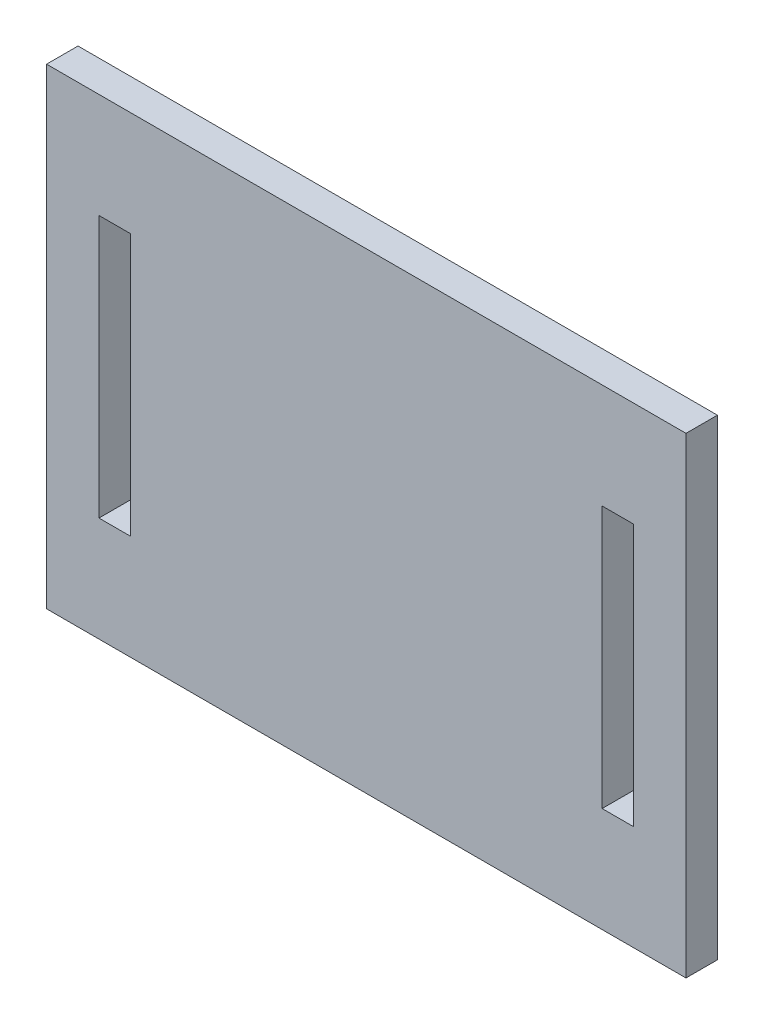
ISO-10303-21;
HEADER;
FILE_DESCRIPTION(('STEP AP214'),'2;1');
FILE_NAME('part.step','',(''),(''),'','','');
FILE_SCHEMA(('AUTOMOTIVE_DESIGN { 1 0 10303 214 1 1 1 1 }'));
ENDSEC;
DATA;
#1=APPLICATION_CONTEXT('core data for automotive mechanical design processes');
#2=APPLICATION_PROTOCOL_DEFINITION('international standard','automotive_design',2000,#1);
#3=PRODUCT_CONTEXT('',#1,'mechanical');
#4=PRODUCT('Part','Part','',(#3));
#5=PRODUCT_RELATED_PRODUCT_CATEGORY('part','',(#4));
#6=PRODUCT_DEFINITION_FORMATION('','',#4);
#7=PRODUCT_DEFINITION_CONTEXT('part definition',#1,'design');
#8=PRODUCT_DEFINITION('design','',#6,#7);
#9=PRODUCT_DEFINITION_SHAPE('','',#8);
#10=(LENGTH_UNIT() NAMED_UNIT(*) SI_UNIT(.MILLI.,.METRE.));
#11=(NAMED_UNIT(*) PLANE_ANGLE_UNIT() SI_UNIT($,.RADIAN.));
#12=(NAMED_UNIT(*) SI_UNIT($,.STERADIAN.) SOLID_ANGLE_UNIT());
#13=UNCERTAINTY_MEASURE_WITH_UNIT(LENGTH_MEASURE(1.E-05),#10,'distance_accuracy_value','');
#14=(GEOMETRIC_REPRESENTATION_CONTEXT(3) GLOBAL_UNCERTAINTY_ASSIGNED_CONTEXT((#13)) GLOBAL_UNIT_ASSIGNED_CONTEXT((#10,
#11,#12)) REPRESENTATION_CONTEXT('',''));
#15=CARTESIAN_POINT('',(0.,0.,0.));
#16=DIRECTION('',(0.,0.,1.));
#17=DIRECTION('',(1.,0.,0.));
#18=AXIS2_PLACEMENT_3D('',#15,#16,#17);
#19=CARTESIAN_POINT('',(-33.3215460110285,14.7916666666667,3.));
#20=DIRECTION('',(1.,0.,0.));
#21=DIRECTION('',(0.,0.,-1.));
#22=AXIS2_PLACEMENT_3D('',#19,#20,#21);
#23=PLANE('',#22);
#24=DIRECTION('',(0.,-1.,0.));
#25=VECTOR('',#24,1.);
#26=CARTESIAN_POINT('',(-33.3215460110285,14.7916666666667,0.));
#27=LINE('',#26,#25);
#28=CARTESIAN_POINT('',(-33.3215460110285,14.7916666666667,0.));
#29=VERTEX_POINT('',#28);
#30=CARTESIAN_POINT('',(-33.3215460110285,-30.2083333333333,0.));
#31=VERTEX_POINT('',#30);
#32=EDGE_CURVE('E185',#29,#31,#27,.T.);
#33=ORIENTED_EDGE('',*,*,#32,.T.);
#34=DIRECTION('',(0.,0.,-1.));
#35=VECTOR('',#34,1.);
#36=CARTESIAN_POINT('',(-33.3215460110285,-30.2083333333333,3.));
#37=LINE('',#36,#35);
#38=CARTESIAN_POINT('',(-33.3215460110285,-30.2083333333333,3.));
#39=VERTEX_POINT('',#38);
#40=EDGE_CURVE('E11',#39,#31,#37,.T.);
#41=ORIENTED_EDGE('',*,*,#40,.F.);
#42=DIRECTION('',(0.,-1.,0.));
#43=VECTOR('',#42,1.);
#44=CARTESIAN_POINT('',(-33.3215460110285,14.7916666666667,3.));
#45=LINE('',#44,#43);
#46=CARTESIAN_POINT('',(-33.3215460110285,14.7916666666667,3.));
#47=VERTEX_POINT('',#46);
#48=EDGE_CURVE('E192',#47,#39,#45,.T.);
#49=ORIENTED_EDGE('',*,*,#48,.F.);
#50=DIRECTION('',(0.,0.,-1.));
#51=VECTOR('',#50,1.);
#52=CARTESIAN_POINT('',(-33.3215460110285,14.7916666666667,3.));
#53=LINE('',#52,#51);
#54=EDGE_CURVE('E202',#47,#29,#53,.T.);
#55=ORIENTED_EDGE('',*,*,#54,.T.);
#56=EDGE_LOOP('',(#33,#41,#49,#55));
#57=FACE_BOUND('',#56,.T.);
#58=ADVANCED_FACE('F35',(#57),#23,.F.);
#59=CARTESIAN_POINT('',(-33.3215460110285,-30.2083333333333,3.));
#60=DIRECTION('',(0.,1.,0.));
#61=DIRECTION('',(0.,0.,1.));
#62=AXIS2_PLACEMENT_3D('',#59,#60,#61);
#63=PLANE('',#62);
#64=DIRECTION('',(1.,0.,0.));
#65=VECTOR('',#64,1.);
#66=CARTESIAN_POINT('',(-33.3215460110285,-30.2083333333333,0.));
#67=LINE('',#66,#65);
#68=CARTESIAN_POINT('',(27.6784539889715,-30.2083333333333,0.));
#69=VERTEX_POINT('',#68);
#70=EDGE_CURVE('E205',#31,#69,#67,.T.);
#71=ORIENTED_EDGE('',*,*,#70,.T.);
#72=DIRECTION('',(0.,0.,-1.));
#73=VECTOR('',#72,1.);
#74=CARTESIAN_POINT('',(27.6784539889715,-30.2083333333333,3.));
#75=LINE('',#74,#73);
#76=CARTESIAN_POINT('',(27.6784539889715,-30.2083333333333,3.));
#77=VERTEX_POINT('',#76);
#78=EDGE_CURVE('E42',#77,#69,#75,.T.);
#79=ORIENTED_EDGE('',*,*,#78,.F.);
#80=DIRECTION('',(1.,0.,0.));
#81=VECTOR('',#80,1.);
#82=CARTESIAN_POINT('',(-33.3215460110285,-30.2083333333333,3.));
#83=LINE('',#82,#81);
#84=EDGE_CURVE('E195',#39,#77,#83,.T.);
#85=ORIENTED_EDGE('',*,*,#84,.F.);
#86=ORIENTED_EDGE('',*,*,#40,.T.);
#87=EDGE_LOOP('',(#71,#79,#85,#86));
#88=FACE_BOUND('',#87,.T.);
#89=ADVANCED_FACE('F234',(#88),#63,.F.);
#90=CARTESIAN_POINT('',(27.6784539889715,14.7916666666667,3.));
#91=DIRECTION('',(-1.,0.,0.));
#92=DIRECTION('',(0.,-1.,0.));
#93=AXIS2_PLACEMENT_3D('',#90,#91,#92);
#94=PLANE('',#93);
#95=DIRECTION('',(0.,1.,0.));
#96=VECTOR('',#95,1.);
#97=CARTESIAN_POINT('',(27.6784539889715,14.7916666666667,0.));
#98=LINE('',#97,#96);
#99=CARTESIAN_POINT('',(27.6784539889715,14.7916666666667,0.));
#100=VERTEX_POINT('',#99);
#101=EDGE_CURVE('E207',#69,#100,#98,.T.);
#102=ORIENTED_EDGE('',*,*,#101,.T.);
#103=DIRECTION('',(0.,0.,-1.));
#104=VECTOR('',#103,1.);
#105=CARTESIAN_POINT('',(27.6784539889715,14.7916666666667,3.));
#106=LINE('',#105,#104);
#107=CARTESIAN_POINT('',(27.6784539889715,14.7916666666667,3.));
#108=VERTEX_POINT('',#107);
#109=EDGE_CURVE('E212',#108,#100,#106,.T.);
#110=ORIENTED_EDGE('',*,*,#109,.F.);
#111=DIRECTION('',(0.,1.,0.));
#112=VECTOR('',#111,1.);
#113=CARTESIAN_POINT('',(27.6784539889715,14.7916666666667,3.));
#114=LINE('',#113,#112);
#115=EDGE_CURVE('E198',#77,#108,#114,.T.);
#116=ORIENTED_EDGE('',*,*,#115,.F.);
#117=ORIENTED_EDGE('',*,*,#78,.T.);
#118=EDGE_LOOP('',(#102,#110,#116,#117));
#119=FACE_BOUND('',#118,.T.);
#120=ADVANCED_FACE('F219',(#119),#94,.F.);
#121=CARTESIAN_POINT('',(-33.3215460110285,14.7916666666667,3.));
#122=DIRECTION('',(0.,-1.,0.));
#123=DIRECTION('',(0.,0.,-1.));
#124=AXIS2_PLACEMENT_3D('',#121,#122,#123);
#125=PLANE('',#124);
#126=DIRECTION('',(-1.,0.,0.));
#127=VECTOR('',#126,1.);
#128=CARTESIAN_POINT('',(-33.3215460110285,14.7916666666667,0.));
#129=LINE('',#128,#127);
#130=EDGE_CURVE('E196',#100,#29,#129,.T.);
#131=ORIENTED_EDGE('',*,*,#130,.T.);
#132=ORIENTED_EDGE('',*,*,#54,.F.);
#133=DIRECTION('',(-1.,0.,0.));
#134=VECTOR('',#133,1.);
#135=CARTESIAN_POINT('',(-33.3215460110285,14.7916666666667,3.));
#136=LINE('',#135,#134);
#137=EDGE_CURVE('E200',#108,#47,#136,.T.);
#138=ORIENTED_EDGE('',*,*,#137,.F.);
#139=ORIENTED_EDGE('',*,*,#109,.T.);
#140=EDGE_LOOP('',(#131,#132,#138,#139));
#141=FACE_BOUND('',#140,.T.);
#142=ADVANCED_FACE('F227',(#141),#125,.F.);
#143=CARTESIAN_POINT('',(0.,0.,3.));
#144=DIRECTION('',(0.,0.,1.));
#145=DIRECTION('',(1.,0.,0.));
#146=AXIS2_PLACEMENT_3D('',#143,#144,#145);
#147=PLANE('',#146);
#148=DIRECTION('',(0.,-1.,0.));
#149=VECTOR('',#148,1.);
#150=CARTESIAN_POINT('',(19.6784539889715,-20.2083333333333,3.));
#151=LINE('',#150,#149);
#152=CARTESIAN_POINT('',(19.6784539889715,4.79166666666667,3.));
#153=VERTEX_POINT('',#152);
#154=CARTESIAN_POINT('',(19.6784539889715,-20.2083333333333,3.));
#155=VERTEX_POINT('',#154);
#156=EDGE_CURVE('E49',#153,#155,#151,.T.);
#157=ORIENTED_EDGE('',*,*,#156,.F.);
#158=DIRECTION('',(-1.,0.,0.));
#159=VECTOR('',#158,1.);
#160=CARTESIAN_POINT('',(19.6784539889715,4.79166666666667,3.));
#161=LINE('',#160,#159);
#162=CARTESIAN_POINT('',(22.6784539889715,4.79166666666667,3.));
#163=VERTEX_POINT('',#162);
#164=EDGE_CURVE('E141',#163,#153,#161,.T.);
#165=ORIENTED_EDGE('',*,*,#164,.F.);
#166=DIRECTION('',(0.,1.,0.));
#167=VECTOR('',#166,1.);
#168=CARTESIAN_POINT('',(22.6784539889715,-20.2083333333333,3.));
#169=LINE('',#168,#167);
#170=CARTESIAN_POINT('',(22.6784539889715,-20.2083333333333,3.));
#171=VERTEX_POINT('',#170);
#172=EDGE_CURVE('E144',#171,#163,#169,.T.);
#173=ORIENTED_EDGE('',*,*,#172,.F.);
#174=DIRECTION('',(1.,0.,0.));
#175=VECTOR('',#174,1.);
#176=CARTESIAN_POINT('',(19.6784539889715,-20.2083333333333,3.));
#177=LINE('',#176,#175);
#178=EDGE_CURVE('E150',#155,#171,#177,.T.);
#179=ORIENTED_EDGE('',*,*,#178,.F.);
#180=EDGE_LOOP('',(#157,#165,#173,#179));
#181=FACE_BOUND('',#180,.T.);
#182=DIRECTION('',(0.,-1.,0.));
#183=VECTOR('',#182,1.);
#184=CARTESIAN_POINT('',(-28.3215460110285,-20.2083333333333,3.));
#185=LINE('',#184,#183);
#186=CARTESIAN_POINT('',(-28.3215460110285,4.79166666666667,3.));
#187=VERTEX_POINT('',#186);
#188=CARTESIAN_POINT('',(-28.3215460110285,-20.2083333333333,3.));
#189=VERTEX_POINT('',#188);
#190=EDGE_CURVE('E156',#187,#189,#185,.T.);
#191=ORIENTED_EDGE('',*,*,#190,.F.);
#192=DIRECTION('',(-1.,0.,0.));
#193=VECTOR('',#192,1.);
#194=CARTESIAN_POINT('',(-28.3215460110285,4.79166666666667,3.));
#195=LINE('',#194,#193);
#196=CARTESIAN_POINT('',(-25.3215460110285,4.79166666666667,3.));
#197=VERTEX_POINT('',#196);
#198=EDGE_CURVE('E164',#197,#187,#195,.T.);
#199=ORIENTED_EDGE('',*,*,#198,.F.);
#200=DIRECTION('',(0.,1.,0.));
#201=VECTOR('',#200,1.);
#202=CARTESIAN_POINT('',(-25.3215460110285,-20.2083333333333,3.));
#203=LINE('',#202,#201);
#204=CARTESIAN_POINT('',(-25.3215460110285,-20.2083333333333,3.));
#205=VERTEX_POINT('',#204);
#206=EDGE_CURVE('E178',#205,#197,#203,.T.);
#207=ORIENTED_EDGE('',*,*,#206,.F.);
#208=DIRECTION('',(1.,0.,0.));
#209=VECTOR('',#208,1.);
#210=CARTESIAN_POINT('',(-28.3215460110285,-20.2083333333333,3.));
#211=LINE('',#210,#209);
#212=EDGE_CURVE('E175',#189,#205,#211,.T.);
#213=ORIENTED_EDGE('',*,*,#212,.F.);
#214=EDGE_LOOP('',(#191,#199,#207,#213));
#215=FACE_BOUND('',#214,.T.);
#216=ORIENTED_EDGE('',*,*,#48,.T.);
#217=ORIENTED_EDGE('',*,*,#84,.T.);
#218=ORIENTED_EDGE('',*,*,#115,.T.);
#219=ORIENTED_EDGE('',*,*,#137,.T.);
#220=EDGE_LOOP('',(#216,#217,#218,#219));
#221=FACE_BOUND('',#220,.T.);
#222=ADVANCED_FACE('F233',(#181,#215,#221),#147,.T.);
#223=CARTESIAN_POINT('',(0.,0.,0.));
#224=DIRECTION('',(0.,0.,1.));
#225=DIRECTION('',(1.,0.,0.));
#226=AXIS2_PLACEMENT_3D('',#223,#224,#225);
#227=PLANE('',#226);
#228=DIRECTION('',(-1.,0.,0.));
#229=VECTOR('',#228,1.);
#230=CARTESIAN_POINT('',(19.6784539889715,4.79166666666667,0.));
#231=LINE('',#230,#229);
#232=CARTESIAN_POINT('',(22.6784539889715,4.79166666666667,0.));
#233=VERTEX_POINT('',#232);
#234=CARTESIAN_POINT('',(19.6784539889715,4.79166666666667,0.));
#235=VERTEX_POINT('',#234);
#236=EDGE_CURVE('E131',#233,#235,#231,.T.);
#237=ORIENTED_EDGE('',*,*,#236,.T.);
#238=DIRECTION('',(0.,-1.,0.));
#239=VECTOR('',#238,1.);
#240=CARTESIAN_POINT('',(19.6784539889715,-20.2083333333333,0.));
#241=LINE('',#240,#239);
#242=CARTESIAN_POINT('',(19.6784539889715,-20.2083333333333,0.));
#243=VERTEX_POINT('',#242);
#244=EDGE_CURVE('E125',#235,#243,#241,.T.);
#245=ORIENTED_EDGE('',*,*,#244,.T.);
#246=DIRECTION('',(1.,0.,0.));
#247=VECTOR('',#246,1.);
#248=CARTESIAN_POINT('',(19.6784539889715,-20.2083333333333,0.));
#249=LINE('',#248,#247);
#250=CARTESIAN_POINT('',(22.6784539889715,-20.2083333333333,0.));
#251=VERTEX_POINT('',#250);
#252=EDGE_CURVE('E134',#243,#251,#249,.T.);
#253=ORIENTED_EDGE('',*,*,#252,.T.);
#254=DIRECTION('',(0.,1.,0.));
#255=VECTOR('',#254,1.);
#256=CARTESIAN_POINT('',(22.6784539889715,-20.2083333333333,0.));
#257=LINE('',#256,#255);
#258=EDGE_CURVE('E57',#251,#233,#257,.T.);
#259=ORIENTED_EDGE('',*,*,#258,.T.);
#260=EDGE_LOOP('',(#237,#245,#253,#259));
#261=FACE_BOUND('',#260,.T.);
#262=DIRECTION('',(-1.,0.,0.));
#263=VECTOR('',#262,1.);
#264=CARTESIAN_POINT('',(-28.3215460110285,4.79166666666667,0.));
#265=LINE('',#264,#263);
#266=CARTESIAN_POINT('',(-25.3215460110285,4.79166666666667,0.));
#267=VERTEX_POINT('',#266);
#268=CARTESIAN_POINT('',(-28.3215460110285,4.79166666666667,0.));
#269=VERTEX_POINT('',#268);
#270=EDGE_CURVE('E170',#267,#269,#265,.T.);
#271=ORIENTED_EDGE('',*,*,#270,.T.);
#272=DIRECTION('',(0.,-1.,0.));
#273=VECTOR('',#272,1.);
#274=CARTESIAN_POINT('',(-28.3215460110285,-20.2083333333333,0.));
#275=LINE('',#274,#273);
#276=CARTESIAN_POINT('',(-28.3215460110285,-20.2083333333333,0.));
#277=VERTEX_POINT('',#276);
#278=EDGE_CURVE('E160',#269,#277,#275,.T.);
#279=ORIENTED_EDGE('',*,*,#278,.T.);
#280=DIRECTION('',(1.,0.,0.));
#281=VECTOR('',#280,1.);
#282=CARTESIAN_POINT('',(-28.3215460110285,-20.2083333333333,0.));
#283=LINE('',#282,#281);
#284=CARTESIAN_POINT('',(-25.3215460110285,-20.2083333333333,0.));
#285=VERTEX_POINT('',#284);
#286=EDGE_CURVE('E163',#277,#285,#283,.T.);
#287=ORIENTED_EDGE('',*,*,#286,.T.);
#288=DIRECTION('',(0.,1.,0.));
#289=VECTOR('',#288,1.);
#290=CARTESIAN_POINT('',(-25.3215460110285,-20.2083333333333,0.));
#291=LINE('',#290,#289);
#292=EDGE_CURVE('E167',#285,#267,#291,.T.);
#293=ORIENTED_EDGE('',*,*,#292,.T.);
#294=EDGE_LOOP('',(#271,#279,#287,#293));
#295=FACE_BOUND('',#294,.T.);
#296=ORIENTED_EDGE('',*,*,#32,.F.);
#297=ORIENTED_EDGE('',*,*,#130,.F.);
#298=ORIENTED_EDGE('',*,*,#101,.F.);
#299=ORIENTED_EDGE('',*,*,#70,.F.);
#300=EDGE_LOOP('',(#296,#297,#298,#299));
#301=FACE_BOUND('',#300,.T.);
#302=ADVANCED_FACE('F138',(#261,#295,#301),#227,.F.);
#303=CARTESIAN_POINT('',(-28.3215460110285,-20.2083333333333,0.));
#304=DIRECTION('',(-1.,0.,0.));
#305=DIRECTION('',(0.,0.,1.));
#306=AXIS2_PLACEMENT_3D('',#303,#304,#305);
#307=PLANE('',#306);
#308=ORIENTED_EDGE('',*,*,#190,.T.);
#309=DIRECTION('',(0.,0.,1.));
#310=VECTOR('',#309,1.);
#311=CARTESIAN_POINT('',(-28.3215460110285,-20.2083333333333,0.));
#312=LINE('',#311,#310);
#313=EDGE_CURVE('E173',#277,#189,#312,.T.);
#314=ORIENTED_EDGE('',*,*,#313,.F.);
#315=ORIENTED_EDGE('',*,*,#278,.F.);
#316=DIRECTION('',(0.,0.,1.));
#317=VECTOR('',#316,1.);
#318=CARTESIAN_POINT('',(-28.3215460110285,4.79166666666667,0.));
#319=LINE('',#318,#317);
#320=EDGE_CURVE('E183',#269,#187,#319,.T.);
#321=ORIENTED_EDGE('',*,*,#320,.T.);
#322=EDGE_LOOP('',(#308,#314,#315,#321));
#323=FACE_BOUND('',#322,.T.);
#324=ADVANCED_FACE('F246',(#323),#307,.F.);
#325=CARTESIAN_POINT('',(-28.3215460110285,4.79166666666667,0.));
#326=DIRECTION('',(0.,1.,0.));
#327=DIRECTION('',(0.,0.,1.));
#328=AXIS2_PLACEMENT_3D('',#325,#326,#327);
#329=PLANE('',#328);
#330=ORIENTED_EDGE('',*,*,#198,.T.);
#331=ORIENTED_EDGE('',*,*,#320,.F.);
#332=ORIENTED_EDGE('',*,*,#270,.F.);
#333=DIRECTION('',(0.,0.,1.));
#334=VECTOR('',#333,1.);
#335=CARTESIAN_POINT('',(-25.3215460110285,4.79166666666667,0.));
#336=LINE('',#335,#334);
#337=EDGE_CURVE('E186',#267,#197,#336,.T.);
#338=ORIENTED_EDGE('',*,*,#337,.T.);
#339=EDGE_LOOP('',(#330,#331,#332,#338));
#340=FACE_BOUND('',#339,.T.);
#341=ADVANCED_FACE('F252',(#340),#329,.F.);
#342=CARTESIAN_POINT('',(-25.3215460110285,-20.2083333333333,0.));
#343=DIRECTION('',(1.,0.,0.));
#344=DIRECTION('',(0.,1.,0.));
#345=AXIS2_PLACEMENT_3D('',#342,#343,#344);
#346=PLANE('',#345);
#347=ORIENTED_EDGE('',*,*,#206,.T.);
#348=ORIENTED_EDGE('',*,*,#337,.F.);
#349=ORIENTED_EDGE('',*,*,#292,.F.);
#350=DIRECTION('',(0.,0.,1.));
#351=VECTOR('',#350,1.);
#352=CARTESIAN_POINT('',(-25.3215460110285,-20.2083333333333,0.));
#353=LINE('',#352,#351);
#354=EDGE_CURVE('E188',#285,#205,#353,.T.);
#355=ORIENTED_EDGE('',*,*,#354,.T.);
#356=EDGE_LOOP('',(#347,#348,#349,#355));
#357=FACE_BOUND('',#356,.T.);
#358=ADVANCED_FACE('F257',(#357),#346,.F.);
#359=CARTESIAN_POINT('',(-28.3215460110285,-20.2083333333333,0.));
#360=DIRECTION('',(0.,-1.,0.));
#361=DIRECTION('',(0.,0.,-1.));
#362=AXIS2_PLACEMENT_3D('',#359,#360,#361);
#363=PLANE('',#362);
#364=ORIENTED_EDGE('',*,*,#212,.T.);
#365=ORIENTED_EDGE('',*,*,#354,.F.);
#366=ORIENTED_EDGE('',*,*,#286,.F.);
#367=ORIENTED_EDGE('',*,*,#313,.T.);
#368=EDGE_LOOP('',(#364,#365,#366,#367));
#369=FACE_BOUND('',#368,.T.);
#370=ADVANCED_FACE('F254',(#369),#363,.F.);
#371=CARTESIAN_POINT('',(19.6784539889715,-20.2083333333333,0.));
#372=DIRECTION('',(-1.,0.,0.));
#373=DIRECTION('',(0.,0.,1.));
#374=AXIS2_PLACEMENT_3D('',#371,#372,#373);
#375=PLANE('',#374);
#376=ORIENTED_EDGE('',*,*,#156,.T.);
#377=DIRECTION('',(0.,0.,1.));
#378=VECTOR('',#377,1.);
#379=CARTESIAN_POINT('',(19.6784539889715,-20.2083333333333,0.));
#380=LINE('',#379,#378);
#381=EDGE_CURVE('E121',#243,#155,#380,.T.);
#382=ORIENTED_EDGE('',*,*,#381,.F.);
#383=ORIENTED_EDGE('',*,*,#244,.F.);
#384=DIRECTION('',(0.,0.,1.));
#385=VECTOR('',#384,1.);
#386=CARTESIAN_POINT('',(19.6784539889715,4.79166666666667,0.));
#387=LINE('',#386,#385);
#388=EDGE_CURVE('E154',#235,#153,#387,.T.);
#389=ORIENTED_EDGE('',*,*,#388,.T.);
#390=EDGE_LOOP('',(#376,#382,#383,#389));
#391=FACE_BOUND('',#390,.T.);
#392=ADVANCED_FACE('F123',(#391),#375,.F.);
#393=CARTESIAN_POINT('',(19.6784539889715,4.79166666666667,0.));
#394=DIRECTION('',(0.,1.,0.));
#395=DIRECTION('',(-1.,0.,0.));
#396=AXIS2_PLACEMENT_3D('',#393,#394,#395);
#397=PLANE('',#396);
#398=ORIENTED_EDGE('',*,*,#164,.T.);
#399=ORIENTED_EDGE('',*,*,#388,.F.);
#400=ORIENTED_EDGE('',*,*,#236,.F.);
#401=DIRECTION('',(0.,0.,1.));
#402=VECTOR('',#401,1.);
#403=CARTESIAN_POINT('',(22.6784539889715,4.79166666666667,0.));
#404=LINE('',#403,#402);
#405=EDGE_CURVE('E157',#233,#163,#404,.T.);
#406=ORIENTED_EDGE('',*,*,#405,.T.);
#407=EDGE_LOOP('',(#398,#399,#400,#406));
#408=FACE_BOUND('',#407,.T.);
#409=ADVANCED_FACE('F267',(#408),#397,.F.);
#410=CARTESIAN_POINT('',(22.6784539889715,-20.2083333333333,0.));
#411=DIRECTION('',(1.,0.,0.));
#412=DIRECTION('',(0.,0.,-1.));
#413=AXIS2_PLACEMENT_3D('',#410,#411,#412);
#414=PLANE('',#413);
#415=ORIENTED_EDGE('',*,*,#172,.T.);
#416=ORIENTED_EDGE('',*,*,#405,.F.);
#417=ORIENTED_EDGE('',*,*,#258,.F.);
#418=DIRECTION('',(0.,0.,1.));
#419=VECTOR('',#418,1.);
#420=CARTESIAN_POINT('',(22.6784539889715,-20.2083333333333,0.));
#421=LINE('',#420,#419);
#422=EDGE_CURVE('E130',#251,#171,#421,.T.);
#423=ORIENTED_EDGE('',*,*,#422,.T.);
#424=EDGE_LOOP('',(#415,#416,#417,#423));
#425=FACE_BOUND('',#424,.T.);
#426=ADVANCED_FACE('F270',(#425),#414,.F.);
#427=CARTESIAN_POINT('',(19.6784539889715,-20.2083333333333,0.));
#428=DIRECTION('',(0.,-1.,0.));
#429=DIRECTION('',(0.,0.,-1.));
#430=AXIS2_PLACEMENT_3D('',#427,#428,#429);
#431=PLANE('',#430);
#432=ORIENTED_EDGE('',*,*,#178,.T.);
#433=ORIENTED_EDGE('',*,*,#422,.F.);
#434=ORIENTED_EDGE('',*,*,#252,.F.);
#435=ORIENTED_EDGE('',*,*,#381,.T.);
#436=EDGE_LOOP('',(#432,#433,#434,#435));
#437=FACE_BOUND('',#436,.T.);
#438=ADVANCED_FACE('F135',(#437),#431,.F.);
#439=CLOSED_SHELL('',(#58,#89,#120,#142,#222,#302,#324,#341,#358,#370,#392,#409,#426,#438));
#440=MANIFOLD_SOLID_BREP('B2',#439);
#441=ADVANCED_BREP_SHAPE_REPRESENTATION('',(#18,#440),#14);
#442=SHAPE_DEFINITION_REPRESENTATION(#9,#441);
ENDSEC;
END-ISO-10303-21;
